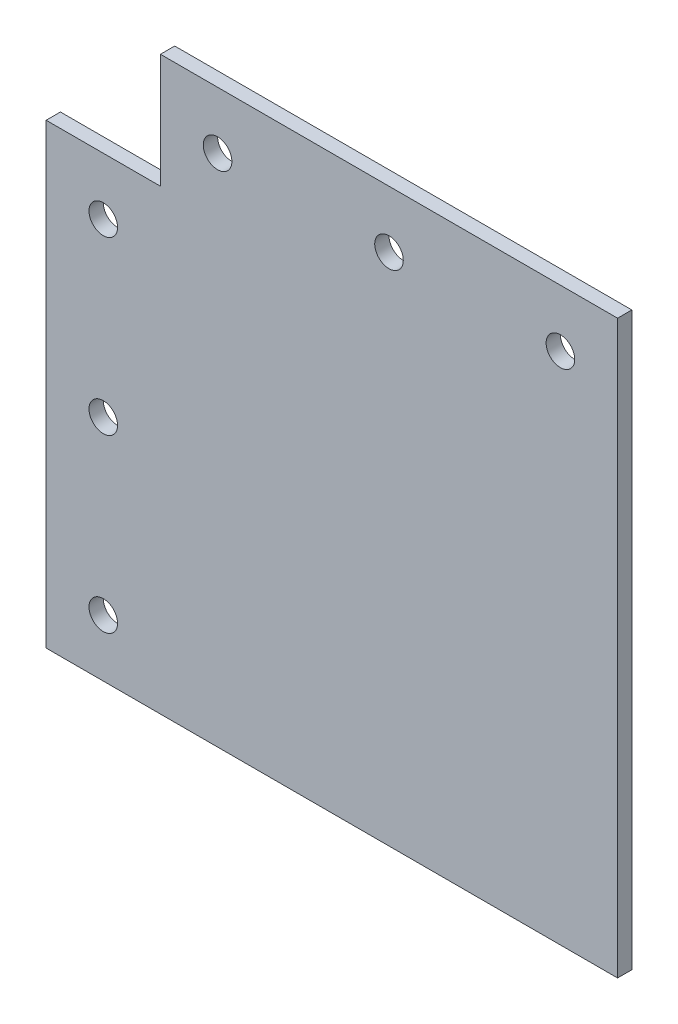
ISO-10303-21;
HEADER;
FILE_DESCRIPTION(('STEP AP214'),'2;1');
FILE_NAME('part.step','',(''),(''),'','','');
FILE_SCHEMA(('AUTOMOTIVE_DESIGN { 1 0 10303 214 1 1 1 1 }'));
ENDSEC;
DATA;
#1=APPLICATION_CONTEXT('core data for automotive mechanical design processes');
#2=APPLICATION_PROTOCOL_DEFINITION('international standard','automotive_design',2000,#1);
#3=PRODUCT_CONTEXT('',#1,'mechanical');
#4=PRODUCT('Part','Part','',(#3));
#5=PRODUCT_RELATED_PRODUCT_CATEGORY('part','',(#4));
#6=PRODUCT_DEFINITION_FORMATION('','',#4);
#7=PRODUCT_DEFINITION_CONTEXT('part definition',#1,'design');
#8=PRODUCT_DEFINITION('design','',#6,#7);
#9=PRODUCT_DEFINITION_SHAPE('','',#8);
#10=(LENGTH_UNIT() NAMED_UNIT(*) SI_UNIT(.MILLI.,.METRE.));
#11=(NAMED_UNIT(*) PLANE_ANGLE_UNIT() SI_UNIT($,.RADIAN.));
#12=(NAMED_UNIT(*) SI_UNIT($,.STERADIAN.) SOLID_ANGLE_UNIT());
#13=UNCERTAINTY_MEASURE_WITH_UNIT(LENGTH_MEASURE(1.E-05),#10,'distance_accuracy_value','');
#14=(GEOMETRIC_REPRESENTATION_CONTEXT(3) GLOBAL_UNCERTAINTY_ASSIGNED_CONTEXT((#13)) GLOBAL_UNIT_ASSIGNED_CONTEXT((#10,
#11,#12)) REPRESENTATION_CONTEXT('',''));
#15=CARTESIAN_POINT('',(0.,0.,0.));
#16=DIRECTION('',(0.,0.,1.));
#17=DIRECTION('',(1.,0.,0.));
#18=AXIS2_PLACEMENT_3D('',#15,#16,#17);
#19=CARTESIAN_POINT('',(0.,0.,3.175));
#20=DIRECTION('',(0.,0.,1.));
#21=DIRECTION('',(1.,0.,0.));
#22=AXIS2_PLACEMENT_3D('',#19,#20,#21);
#23=PLANE('',#22);
#24=CARTESIAN_POINT('',(76.2,114.3,3.175));
#25=DIRECTION('',(0.,0.,1.));
#26=DIRECTION('',(1.,0.,0.));
#27=AXIS2_PLACEMENT_3D('',#24,#25,#26);
#28=CIRCLE('',#27,3.175);
#29=CARTESIAN_POINT('',(79.375,114.3,3.175));
#30=VERTEX_POINT('',#29);
#31=EDGE_CURVE('E198',#30,#30,#28,.T.);
#32=ORIENTED_EDGE('',*,*,#31,.F.);
#33=EDGE_LOOP('',(#32));
#34=FACE_BOUND('',#33,.T.);
#35=CARTESIAN_POINT('',(12.7,12.7,3.175));
#36=DIRECTION('',(0.,0.,1.));
#37=DIRECTION('',(1.,0.,0.));
#38=AXIS2_PLACEMENT_3D('',#35,#36,#37);
#39=CIRCLE('',#38,3.175);
#40=CARTESIAN_POINT('',(15.875,12.7,3.175));
#41=VERTEX_POINT('',#40);
#42=EDGE_CURVE('E210',#41,#41,#39,.T.);
#43=ORIENTED_EDGE('',*,*,#42,.F.);
#44=EDGE_LOOP('',(#43));
#45=FACE_BOUND('',#44,.T.);
#46=CARTESIAN_POINT('',(12.7,88.9,3.175));
#47=DIRECTION('',(0.,0.,1.));
#48=DIRECTION('',(1.,0.,0.));
#49=AXIS2_PLACEMENT_3D('',#46,#47,#48);
#50=CIRCLE('',#49,3.175);
#51=CARTESIAN_POINT('',(15.875,88.9,3.175));
#52=VERTEX_POINT('',#51);
#53=EDGE_CURVE('E122',#52,#52,#50,.T.);
#54=ORIENTED_EDGE('',*,*,#53,.F.);
#55=EDGE_LOOP('',(#54));
#56=FACE_BOUND('',#55,.T.);
#57=DIRECTION('',(0.,-1.,0.));
#58=VECTOR('',#57,1.);
#59=CARTESIAN_POINT('',(0.,0.,3.175));
#60=LINE('',#59,#58);
#61=CARTESIAN_POINT('',(0.,101.6,3.175));
#62=VERTEX_POINT('',#61);
#63=CARTESIAN_POINT('',(0.,0.,3.175));
#64=VERTEX_POINT('',#63);
#65=EDGE_CURVE('E129',#62,#64,#60,.T.);
#66=ORIENTED_EDGE('',*,*,#65,.T.);
#67=DIRECTION('',(1.,0.,0.));
#68=VECTOR('',#67,1.);
#69=CARTESIAN_POINT('',(0.,0.,3.175));
#70=LINE('',#69,#68);
#71=CARTESIAN_POINT('',(127.,0.,3.175));
#72=VERTEX_POINT('',#71);
#73=EDGE_CURVE('E87',#64,#72,#70,.T.);
#74=ORIENTED_EDGE('',*,*,#73,.T.);
#75=DIRECTION('',(0.,1.,0.));
#76=VECTOR('',#75,1.);
#77=CARTESIAN_POINT('',(127.,0.,3.175));
#78=LINE('',#77,#76);
#79=CARTESIAN_POINT('',(127.,127.,3.175));
#80=VERTEX_POINT('',#79);
#81=EDGE_CURVE('E100',#72,#80,#78,.T.);
#82=ORIENTED_EDGE('',*,*,#81,.T.);
#83=DIRECTION('',(-1.,0.,0.));
#84=VECTOR('',#83,1.);
#85=CARTESIAN_POINT('',(25.4,127.,3.175));
#86=LINE('',#85,#84);
#87=CARTESIAN_POINT('',(25.4,127.,3.175));
#88=VERTEX_POINT('',#87);
#89=EDGE_CURVE('E94',#80,#88,#86,.T.);
#90=ORIENTED_EDGE('',*,*,#89,.T.);
#91=DIRECTION('',(0.,-1.,0.));
#92=VECTOR('',#91,1.);
#93=CARTESIAN_POINT('',(25.4,127.,3.175));
#94=LINE('',#93,#92);
#95=CARTESIAN_POINT('',(25.4,101.6,3.175));
#96=VERTEX_POINT('',#95);
#97=EDGE_CURVE('E98',#88,#96,#94,.T.);
#98=ORIENTED_EDGE('',*,*,#97,.T.);
#99=DIRECTION('',(-1.,0.,0.));
#100=VECTOR('',#99,1.);
#101=CARTESIAN_POINT('',(25.4,101.6,3.175));
#102=LINE('',#101,#100);
#103=EDGE_CURVE('E50',#96,#62,#102,.T.);
#104=ORIENTED_EDGE('',*,*,#103,.T.);
#105=EDGE_LOOP('',(#66,#74,#82,#90,#98,#104));
#106=FACE_BOUND('',#105,.T.);
#107=CARTESIAN_POINT('',(12.7,50.8,3.175));
#108=DIRECTION('',(0.,0.,1.));
#109=DIRECTION('',(1.,0.,0.));
#110=AXIS2_PLACEMENT_3D('',#107,#108,#109);
#111=CIRCLE('',#110,3.175);
#112=CARTESIAN_POINT('',(15.875,50.8,3.175));
#113=VERTEX_POINT('',#112);
#114=EDGE_CURVE('E216',#113,#113,#111,.T.);
#115=ORIENTED_EDGE('',*,*,#114,.F.);
#116=EDGE_LOOP('',(#115));
#117=FACE_BOUND('',#116,.T.);
#118=CARTESIAN_POINT('',(38.1,114.3,3.175));
#119=DIRECTION('',(0.,0.,1.));
#120=DIRECTION('',(1.,0.,0.));
#121=AXIS2_PLACEMENT_3D('',#118,#119,#120);
#122=CIRCLE('',#121,3.175);
#123=CARTESIAN_POINT('',(41.275,114.3,3.175));
#124=VERTEX_POINT('',#123);
#125=EDGE_CURVE('E204',#124,#124,#122,.T.);
#126=ORIENTED_EDGE('',*,*,#125,.F.);
#127=EDGE_LOOP('',(#126));
#128=FACE_BOUND('',#127,.T.);
#129=CARTESIAN_POINT('',(114.3,114.3,3.175));
#130=DIRECTION('',(0.,0.,1.));
#131=DIRECTION('',(1.,0.,0.));
#132=AXIS2_PLACEMENT_3D('',#129,#130,#131);
#133=CIRCLE('',#132,3.175);
#134=CARTESIAN_POINT('',(117.475,114.3,3.175));
#135=VERTEX_POINT('',#134);
#136=EDGE_CURVE('E189',#135,#135,#133,.T.);
#137=ORIENTED_EDGE('',*,*,#136,.F.);
#138=EDGE_LOOP('',(#137));
#139=FACE_BOUND('',#138,.T.);
#140=ADVANCED_FACE('F33',(#34,#45,#56,#106,#117,#128,#139),#23,.T.);
#141=CARTESIAN_POINT('',(0.,0.,0.));
#142=DIRECTION('',(0.,0.,1.));
#143=DIRECTION('',(1.,0.,0.));
#144=AXIS2_PLACEMENT_3D('',#141,#142,#143);
#145=PLANE('',#144);
#146=CARTESIAN_POINT('',(76.2,114.3,0.));
#147=DIRECTION('',(0.,0.,1.));
#148=DIRECTION('',(1.,0.,0.));
#149=AXIS2_PLACEMENT_3D('',#146,#147,#148);
#150=CIRCLE('',#149,3.175);
#151=CARTESIAN_POINT('',(79.375,114.3,0.));
#152=VERTEX_POINT('',#151);
#153=EDGE_CURVE('E195',#152,#152,#150,.T.);
#154=ORIENTED_EDGE('',*,*,#153,.T.);
#155=EDGE_LOOP('',(#154));
#156=FACE_BOUND('',#155,.T.);
#157=CARTESIAN_POINT('',(12.7,12.7,0.));
#158=DIRECTION('',(0.,0.,1.));
#159=DIRECTION('',(1.,0.,0.));
#160=AXIS2_PLACEMENT_3D('',#157,#158,#159);
#161=CIRCLE('',#160,3.175);
#162=CARTESIAN_POINT('',(15.875,12.7,0.));
#163=VERTEX_POINT('',#162);
#164=EDGE_CURVE('E207',#163,#163,#161,.T.);
#165=ORIENTED_EDGE('',*,*,#164,.T.);
#166=EDGE_LOOP('',(#165));
#167=FACE_BOUND('',#166,.T.);
#168=CARTESIAN_POINT('',(12.7,88.9,0.));
#169=DIRECTION('',(0.,0.,1.));
#170=DIRECTION('',(1.,0.,0.));
#171=AXIS2_PLACEMENT_3D('',#168,#169,#170);
#172=CIRCLE('',#171,3.175);
#173=CARTESIAN_POINT('',(15.875,88.9,0.));
#174=VERTEX_POINT('',#173);
#175=EDGE_CURVE('E219',#174,#174,#172,.T.);
#176=ORIENTED_EDGE('',*,*,#175,.T.);
#177=EDGE_LOOP('',(#176));
#178=FACE_BOUND('',#177,.T.);
#179=DIRECTION('',(0.,-1.,0.));
#180=VECTOR('',#179,1.);
#181=CARTESIAN_POINT('',(0.,0.,0.));
#182=LINE('',#181,#180);
#183=CARTESIAN_POINT('',(0.,101.6,0.));
#184=VERTEX_POINT('',#183);
#185=CARTESIAN_POINT('',(0.,0.,0.));
#186=VERTEX_POINT('',#185);
#187=EDGE_CURVE('E118',#184,#186,#182,.T.);
#188=ORIENTED_EDGE('',*,*,#187,.F.);
#189=DIRECTION('',(-1.,0.,0.));
#190=VECTOR('',#189,1.);
#191=CARTESIAN_POINT('',(25.4,101.6,0.));
#192=LINE('',#191,#190);
#193=CARTESIAN_POINT('',(25.4,101.6,0.));
#194=VERTEX_POINT('',#193);
#195=EDGE_CURVE('E79',#194,#184,#192,.T.);
#196=ORIENTED_EDGE('',*,*,#195,.F.);
#197=DIRECTION('',(0.,-1.,0.));
#198=VECTOR('',#197,1.);
#199=CARTESIAN_POINT('',(25.4,127.,0.));
#200=LINE('',#199,#198);
#201=CARTESIAN_POINT('',(25.4,127.,0.));
#202=VERTEX_POINT('',#201);
#203=EDGE_CURVE('E73',#202,#194,#200,.T.);
#204=ORIENTED_EDGE('',*,*,#203,.F.);
#205=DIRECTION('',(-1.,0.,0.));
#206=VECTOR('',#205,1.);
#207=CARTESIAN_POINT('',(25.4,127.,0.));
#208=LINE('',#207,#206);
#209=CARTESIAN_POINT('',(127.,127.,0.));
#210=VERTEX_POINT('',#209);
#211=EDGE_CURVE('E108',#210,#202,#208,.T.);
#212=ORIENTED_EDGE('',*,*,#211,.F.);
#213=DIRECTION('',(0.,1.,0.));
#214=VECTOR('',#213,1.);
#215=CARTESIAN_POINT('',(127.,0.,0.));
#216=LINE('',#215,#214);
#217=CARTESIAN_POINT('',(127.,0.,0.));
#218=VERTEX_POINT('',#217);
#219=EDGE_CURVE('E124',#218,#210,#216,.T.);
#220=ORIENTED_EDGE('',*,*,#219,.F.);
#221=DIRECTION('',(1.,0.,0.));
#222=VECTOR('',#221,1.);
#223=CARTESIAN_POINT('',(0.,0.,0.));
#224=LINE('',#223,#222);
#225=EDGE_CURVE('E121',#186,#218,#224,.T.);
#226=ORIENTED_EDGE('',*,*,#225,.F.);
#227=EDGE_LOOP('',(#188,#196,#204,#212,#220,#226));
#228=FACE_BOUND('',#227,.T.);
#229=CARTESIAN_POINT('',(12.7,50.8,0.));
#230=DIRECTION('',(0.,0.,1.));
#231=DIRECTION('',(1.,0.,0.));
#232=AXIS2_PLACEMENT_3D('',#229,#230,#231);
#233=CIRCLE('',#232,3.175);
#234=CARTESIAN_POINT('',(15.875,50.8,0.));
#235=VERTEX_POINT('',#234);
#236=EDGE_CURVE('E213',#235,#235,#233,.T.);
#237=ORIENTED_EDGE('',*,*,#236,.T.);
#238=EDGE_LOOP('',(#237));
#239=FACE_BOUND('',#238,.T.);
#240=CARTESIAN_POINT('',(38.1,114.3,0.));
#241=DIRECTION('',(0.,0.,1.));
#242=DIRECTION('',(1.,0.,0.));
#243=AXIS2_PLACEMENT_3D('',#240,#241,#242);
#244=CIRCLE('',#243,3.175);
#245=CARTESIAN_POINT('',(41.275,114.3,0.));
#246=VERTEX_POINT('',#245);
#247=EDGE_CURVE('E201',#246,#246,#244,.T.);
#248=ORIENTED_EDGE('',*,*,#247,.T.);
#249=EDGE_LOOP('',(#248));
#250=FACE_BOUND('',#249,.T.);
#251=CARTESIAN_POINT('',(114.3,114.3,0.));
#252=DIRECTION('',(0.,0.,1.));
#253=DIRECTION('',(1.,0.,0.));
#254=AXIS2_PLACEMENT_3D('',#251,#252,#253);
#255=CIRCLE('',#254,3.175);
#256=CARTESIAN_POINT('',(117.475,114.3,0.));
#257=VERTEX_POINT('',#256);
#258=EDGE_CURVE('E192',#257,#257,#255,.T.);
#259=ORIENTED_EDGE('',*,*,#258,.T.);
#260=EDGE_LOOP('',(#259));
#261=FACE_BOUND('',#260,.T.);
#262=ADVANCED_FACE('F138',(#156,#167,#178,#228,#239,#250,#261),#145,.F.);
#263=CARTESIAN_POINT('',(0.,0.,3.175));
#264=DIRECTION('',(1.,0.,0.));
#265=DIRECTION('',(0.,1.,0.));
#266=AXIS2_PLACEMENT_3D('',#263,#264,#265);
#267=PLANE('',#266);
#268=ORIENTED_EDGE('',*,*,#187,.T.);
#269=DIRECTION('',(0.,0.,-1.));
#270=VECTOR('',#269,1.);
#271=CARTESIAN_POINT('',(0.,0.,3.175));
#272=LINE('',#271,#270);
#273=EDGE_CURVE('E11',#64,#186,#272,.T.);
#274=ORIENTED_EDGE('',*,*,#273,.F.);
#275=ORIENTED_EDGE('',*,*,#65,.F.);
#276=DIRECTION('',(0.,0.,-1.));
#277=VECTOR('',#276,1.);
#278=CARTESIAN_POINT('',(0.,101.6,3.175));
#279=LINE('',#278,#277);
#280=EDGE_CURVE('E114',#62,#184,#279,.T.);
#281=ORIENTED_EDGE('',*,*,#280,.T.);
#282=EDGE_LOOP('',(#268,#274,#275,#281));
#283=FACE_BOUND('',#282,.T.);
#284=ADVANCED_FACE('F35',(#283),#267,.F.);
#285=CARTESIAN_POINT('',(0.,0.,3.175));
#286=DIRECTION('',(0.,1.,0.));
#287=DIRECTION('',(0.,0.,1.));
#288=AXIS2_PLACEMENT_3D('',#285,#286,#287);
#289=PLANE('',#288);
#290=ORIENTED_EDGE('',*,*,#225,.T.);
#291=DIRECTION('',(0.,0.,-1.));
#292=VECTOR('',#291,1.);
#293=CARTESIAN_POINT('',(127.,0.,3.175));
#294=LINE('',#293,#292);
#295=EDGE_CURVE('E42',#72,#218,#294,.T.);
#296=ORIENTED_EDGE('',*,*,#295,.F.);
#297=ORIENTED_EDGE('',*,*,#73,.F.);
#298=ORIENTED_EDGE('',*,*,#273,.T.);
#299=EDGE_LOOP('',(#290,#296,#297,#298));
#300=FACE_BOUND('',#299,.T.);
#301=ADVANCED_FACE('F294',(#300),#289,.F.);
#302=CARTESIAN_POINT('',(127.,0.,3.175));
#303=DIRECTION('',(-1.,0.,0.));
#304=DIRECTION('',(0.,0.,1.));
#305=AXIS2_PLACEMENT_3D('',#302,#303,#304);
#306=PLANE('',#305);
#307=ORIENTED_EDGE('',*,*,#219,.T.);
#308=DIRECTION('',(0.,0.,-1.));
#309=VECTOR('',#308,1.);
#310=CARTESIAN_POINT('',(127.,127.,3.175));
#311=LINE('',#310,#309);
#312=EDGE_CURVE('E109',#80,#210,#311,.T.);
#313=ORIENTED_EDGE('',*,*,#312,.F.);
#314=ORIENTED_EDGE('',*,*,#81,.F.);
#315=ORIENTED_EDGE('',*,*,#295,.T.);
#316=EDGE_LOOP('',(#307,#313,#314,#315));
#317=FACE_BOUND('',#316,.T.);
#318=ADVANCED_FACE('F135',(#317),#306,.F.);
#319=CARTESIAN_POINT('',(25.4,127.,3.175));
#320=DIRECTION('',(0.,-1.,0.));
#321=DIRECTION('',(0.,0.,-1.));
#322=AXIS2_PLACEMENT_3D('',#319,#320,#321);
#323=PLANE('',#322);
#324=ORIENTED_EDGE('',*,*,#211,.T.);
#325=DIRECTION('',(0.,0.,-1.));
#326=VECTOR('',#325,1.);
#327=CARTESIAN_POINT('',(25.4,127.,3.175));
#328=LINE('',#327,#326);
#329=EDGE_CURVE('E105',#88,#202,#328,.T.);
#330=ORIENTED_EDGE('',*,*,#329,.F.);
#331=ORIENTED_EDGE('',*,*,#89,.F.);
#332=ORIENTED_EDGE('',*,*,#312,.T.);
#333=EDGE_LOOP('',(#324,#330,#331,#332));
#334=FACE_BOUND('',#333,.T.);
#335=ADVANCED_FACE('F106',(#334),#323,.F.);
#336=CARTESIAN_POINT('',(25.4,127.,3.175));
#337=DIRECTION('',(1.,0.,0.));
#338=DIRECTION('',(0.,1.,0.));
#339=AXIS2_PLACEMENT_3D('',#336,#337,#338);
#340=PLANE('',#339);
#341=ORIENTED_EDGE('',*,*,#203,.T.);
#342=DIRECTION('',(0.,0.,-1.));
#343=VECTOR('',#342,1.);
#344=CARTESIAN_POINT('',(25.4,101.6,3.175));
#345=LINE('',#344,#343);
#346=EDGE_CURVE('E110',#96,#194,#345,.T.);
#347=ORIENTED_EDGE('',*,*,#346,.F.);
#348=ORIENTED_EDGE('',*,*,#97,.F.);
#349=ORIENTED_EDGE('',*,*,#329,.T.);
#350=EDGE_LOOP('',(#341,#347,#348,#349));
#351=FACE_BOUND('',#350,.T.);
#352=ADVANCED_FACE('F112',(#351),#340,.F.);
#353=CARTESIAN_POINT('',(25.4,101.6,3.175));
#354=DIRECTION('',(0.,-1.,0.));
#355=DIRECTION('',(0.,0.,-1.));
#356=AXIS2_PLACEMENT_3D('',#353,#354,#355);
#357=PLANE('',#356);
#358=ORIENTED_EDGE('',*,*,#195,.T.);
#359=ORIENTED_EDGE('',*,*,#280,.F.);
#360=ORIENTED_EDGE('',*,*,#103,.F.);
#361=ORIENTED_EDGE('',*,*,#346,.T.);
#362=EDGE_LOOP('',(#358,#359,#360,#361));
#363=FACE_BOUND('',#362,.T.);
#364=ADVANCED_FACE('F143',(#363),#357,.F.);
#365=CARTESIAN_POINT('',(12.7,88.9,3.175));
#366=DIRECTION('',(0.,0.,-1.));
#367=DIRECTION('',(-1.,0.,0.));
#368=AXIS2_PLACEMENT_3D('',#365,#366,#367);
#369=CYLINDRICAL_SURFACE('',#368,3.175);
#370=ORIENTED_EDGE('',*,*,#53,.T.);
#371=EDGE_LOOP('',(#370));
#372=FACE_BOUND('',#371,.T.);
#373=ORIENTED_EDGE('',*,*,#175,.F.);
#374=EDGE_LOOP('',(#373));
#375=FACE_BOUND('',#374,.T.);
#376=ADVANCED_FACE('F145',(#372,#375),#369,.F.);
#377=CARTESIAN_POINT('',(12.7,50.8,3.175));
#378=DIRECTION('',(0.,0.,-1.));
#379=DIRECTION('',(-1.,0.,0.));
#380=AXIS2_PLACEMENT_3D('',#377,#378,#379);
#381=CYLINDRICAL_SURFACE('',#380,3.175);
#382=ORIENTED_EDGE('',*,*,#114,.T.);
#383=EDGE_LOOP('',(#382));
#384=FACE_BOUND('',#383,.T.);
#385=ORIENTED_EDGE('',*,*,#236,.F.);
#386=EDGE_LOOP('',(#385));
#387=FACE_BOUND('',#386,.T.);
#388=ADVANCED_FACE('F151',(#384,#387),#381,.F.);
#389=CARTESIAN_POINT('',(12.7,12.7,3.175));
#390=DIRECTION('',(0.,0.,-1.));
#391=DIRECTION('',(-1.,0.,0.));
#392=AXIS2_PLACEMENT_3D('',#389,#390,#391);
#393=CYLINDRICAL_SURFACE('',#392,3.175);
#394=ORIENTED_EDGE('',*,*,#42,.T.);
#395=EDGE_LOOP('',(#394));
#396=FACE_BOUND('',#395,.T.);
#397=ORIENTED_EDGE('',*,*,#164,.F.);
#398=EDGE_LOOP('',(#397));
#399=FACE_BOUND('',#398,.T.);
#400=ADVANCED_FACE('F168',(#396,#399),#393,.F.);
#401=CARTESIAN_POINT('',(38.1,114.3,3.175));
#402=DIRECTION('',(0.,0.,-1.));
#403=DIRECTION('',(-1.,0.,0.));
#404=AXIS2_PLACEMENT_3D('',#401,#402,#403);
#405=CYLINDRICAL_SURFACE('',#404,3.175);
#406=ORIENTED_EDGE('',*,*,#125,.T.);
#407=EDGE_LOOP('',(#406));
#408=FACE_BOUND('',#407,.T.);
#409=ORIENTED_EDGE('',*,*,#247,.F.);
#410=EDGE_LOOP('',(#409));
#411=FACE_BOUND('',#410,.T.);
#412=ADVANCED_FACE('F172',(#408,#411),#405,.F.);
#413=CARTESIAN_POINT('',(76.2,114.3,3.175));
#414=DIRECTION('',(0.,0.,-1.));
#415=DIRECTION('',(-1.,0.,0.));
#416=AXIS2_PLACEMENT_3D('',#413,#414,#415);
#417=CYLINDRICAL_SURFACE('',#416,3.175);
#418=ORIENTED_EDGE('',*,*,#31,.T.);
#419=EDGE_LOOP('',(#418));
#420=FACE_BOUND('',#419,.T.);
#421=ORIENTED_EDGE('',*,*,#153,.F.);
#422=EDGE_LOOP('',(#421));
#423=FACE_BOUND('',#422,.T.);
#424=ADVANCED_FACE('F176',(#420,#423),#417,.F.);
#425=CARTESIAN_POINT('',(114.3,114.3,3.175));
#426=DIRECTION('',(0.,0.,-1.));
#427=DIRECTION('',(-1.,0.,0.));
#428=AXIS2_PLACEMENT_3D('',#425,#426,#427);
#429=CYLINDRICAL_SURFACE('',#428,3.175);
#430=ORIENTED_EDGE('',*,*,#136,.T.);
#431=EDGE_LOOP('',(#430));
#432=FACE_BOUND('',#431,.T.);
#433=ORIENTED_EDGE('',*,*,#258,.F.);
#434=EDGE_LOOP('',(#433));
#435=FACE_BOUND('',#434,.T.);
#436=ADVANCED_FACE('F180',(#432,#435),#429,.F.);
#437=CLOSED_SHELL('',(#140,#262,#284,#301,#318,#335,#352,#364,#376,#388,#400,#412,#424,#436));
#438=MANIFOLD_SOLID_BREP('B2',#437);
#439=ADVANCED_BREP_SHAPE_REPRESENTATION('',(#18,#438),#14);
#440=SHAPE_DEFINITION_REPRESENTATION(#9,#439);
ENDSEC;
END-ISO-10303-21;
